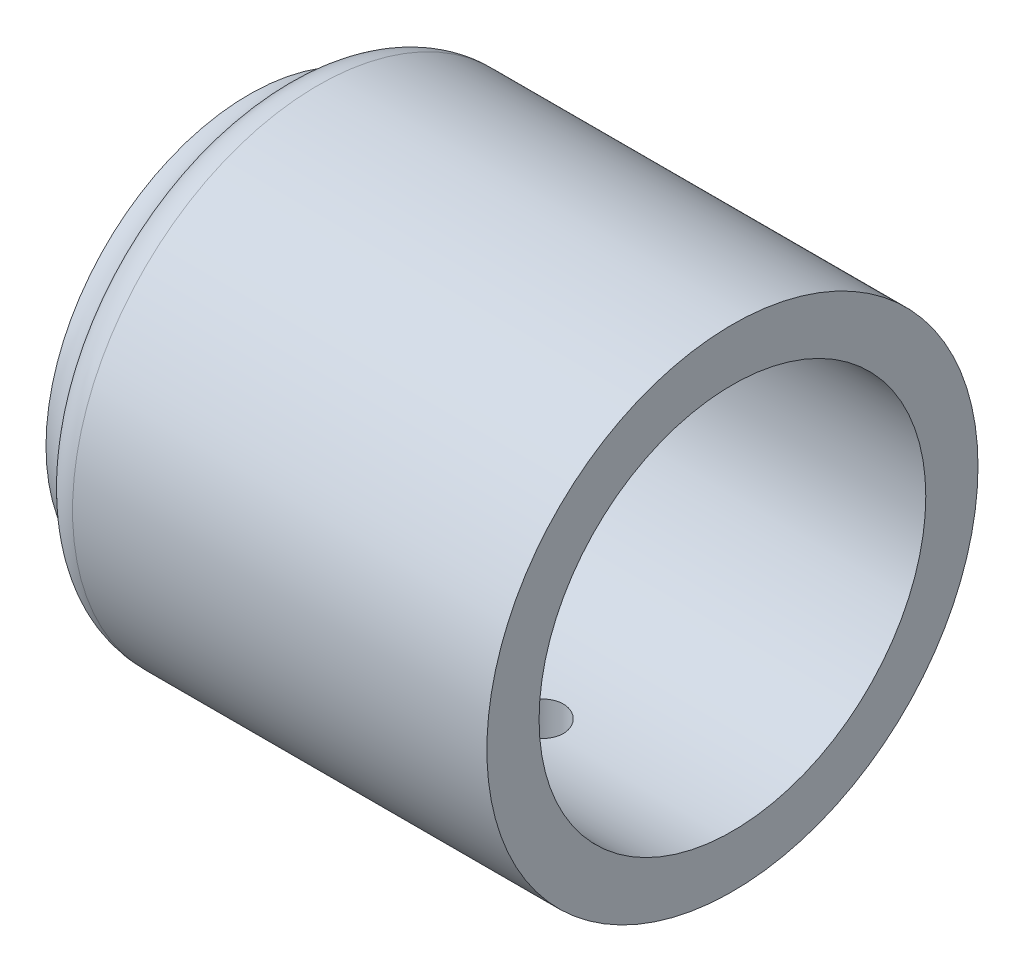
ISO-10303-21;
HEADER;
FILE_DESCRIPTION(('STEP AP214'),'2;1');
FILE_NAME('part.step','',(''),(''),'','','');
FILE_SCHEMA(('AUTOMOTIVE_DESIGN { 1 0 10303 214 1 1 1 1 }'));
ENDSEC;
DATA;
#1=APPLICATION_CONTEXT('core data for automotive mechanical design processes');
#2=APPLICATION_PROTOCOL_DEFINITION('international standard','automotive_design',2000,#1);
#3=PRODUCT_CONTEXT('',#1,'mechanical');
#4=PRODUCT('Part','Part','',(#3));
#5=PRODUCT_RELATED_PRODUCT_CATEGORY('part','',(#4));
#6=PRODUCT_DEFINITION_FORMATION('','',#4);
#7=PRODUCT_DEFINITION_CONTEXT('part definition',#1,'design');
#8=PRODUCT_DEFINITION('design','',#6,#7);
#9=PRODUCT_DEFINITION_SHAPE('','',#8);
#10=(LENGTH_UNIT() NAMED_UNIT(*) SI_UNIT(.MILLI.,.METRE.));
#11=(NAMED_UNIT(*) PLANE_ANGLE_UNIT() SI_UNIT($,.RADIAN.));
#12=(NAMED_UNIT(*) SI_UNIT($,.STERADIAN.) SOLID_ANGLE_UNIT());
#13=UNCERTAINTY_MEASURE_WITH_UNIT(LENGTH_MEASURE(1.E-05),#10,'distance_accuracy_value','');
#14=(GEOMETRIC_REPRESENTATION_CONTEXT(3) GLOBAL_UNCERTAINTY_ASSIGNED_CONTEXT((#13)) GLOBAL_UNIT_ASSIGNED_CONTEXT((#10,
#11,#12)) REPRESENTATION_CONTEXT('',''));
#15=CARTESIAN_POINT('',(0.,0.,0.));
#16=DIRECTION('',(0.,0.,1.));
#17=DIRECTION('',(1.,0.,0.));
#18=AXIS2_PLACEMENT_3D('',#15,#16,#17);
#19=CARTESIAN_POINT('',(0.,0.,0.));
#20=DIRECTION('',(1.,0.,0.));
#21=DIRECTION('',(0.,0.,-1.));
#22=AXIS2_PLACEMENT_3D('',#19,#20,#21);
#23=PLANE('',#22);
#24=CARTESIAN_POINT('',(0.,0.,0.));
#25=DIRECTION('',(1.,0.,0.));
#26=DIRECTION('',(0.,0.,-1.));
#27=AXIS2_PLACEMENT_3D('',#24,#25,#26);
#28=CIRCLE('',#27,20.);
#29=CARTESIAN_POINT('',(0.,0.,-20.));
#30=VERTEX_POINT('',#29);
#31=EDGE_CURVE('E72',#30,#30,#28,.T.);
#32=ORIENTED_EDGE('',*,*,#31,.T.);
#33=EDGE_LOOP('',(#32));
#34=FACE_BOUND('',#33,.T.);
#35=CARTESIAN_POINT('',(0.,0.,0.));
#36=DIRECTION('',(-1.,0.,0.));
#37=DIRECTION('',(0.,0.,1.));
#38=AXIS2_PLACEMENT_3D('',#35,#36,#37);
#39=CIRCLE('',#38,21.);
#40=CARTESIAN_POINT('',(0.,0.,21.));
#41=VERTEX_POINT('',#40);
#42=EDGE_CURVE('E76',#41,#41,#39,.T.);
#43=ORIENTED_EDGE('',*,*,#42,.T.);
#44=EDGE_LOOP('',(#43));
#45=FACE_BOUND('',#44,.T.);
#46=ADVANCED_FACE('F42',(#34,#45),#23,.F.);
#47=CARTESIAN_POINT('',(50.,0.,0.));
#48=DIRECTION('',(-1.,0.,0.));
#49=DIRECTION('',(0.,0.,1.));
#50=AXIS2_PLACEMENT_3D('',#47,#48,#49);
#51=CYLINDRICAL_SURFACE('',#50,25.4);
#52=CARTESIAN_POINT('',(30.,-25.2766690843552,-2.5));
#53=CARTESIAN_POINT('',(29.8599392874787,-25.2766707025076,-2.49999392741206));
#54=CARTESIAN_POINT('',(29.7197856861212,-25.2778457660977,-2.48819016159893));
#55=CARTESIAN_POINT('',(29.4433634814112,-25.2824184676948,-2.44128047461408));
#56=CARTESIAN_POINT('',(29.3070993456217,-25.2858185620687,-2.40614879950283));
#57=CARTESIAN_POINT('',(29.042499161724,-25.2944525432321,-2.31361548797265));
#58=CARTESIAN_POINT('',(28.9141583929871,-25.2996853254849,-2.25622726305069));
#59=CARTESIAN_POINT('',(28.6689589207026,-25.3113937178584,-2.12083545980813));
#60=CARTESIAN_POINT('',(28.552097925335,-25.3178690791454,-2.0428360078297));
#61=CARTESIAN_POINT('',(28.3327350404185,-25.3313586089453,-1.86814015343058));
#62=CARTESIAN_POINT('',(28.230279323911,-25.338374403265,-1.77138589215988));
#63=CARTESIAN_POINT('',(28.0430328421782,-25.3521395241546,-1.56205044121555));
#64=CARTESIAN_POINT('',(27.9582428814143,-25.3588888385781,-1.44946853117488));
#65=CARTESIAN_POINT('',(27.8085757675582,-25.3713765287877,-1.21139142880119));
#66=CARTESIAN_POINT('',(27.7437393912779,-25.3771128243295,-1.08587048373753));
#67=CARTESIAN_POINT('',(27.6360807803164,-25.3869104761499,-0.825657269984008));
#68=CARTESIAN_POINT('',(27.5932580245342,-25.390971872076,-0.690965218475884));
#69=CARTESIAN_POINT('',(27.5309774149862,-25.3969507090018,-0.416699063657356));
#70=CARTESIAN_POINT('',(27.5114438373639,-25.3988750969919,-0.277142309629321));
#71=CARTESIAN_POINT('',(27.4960617896783,-25.4003867093008,0.00328114766783114));
#72=CARTESIAN_POINT('',(27.5002127232328,-25.3999739924685,0.144147817863746));
#73=CARTESIAN_POINT('',(27.5320203503243,-25.3968635881262,0.422678429229586));
#74=CARTESIAN_POINT('',(27.559595617047,-25.3941738161433,0.560351769909405));
#75=CARTESIAN_POINT('',(27.6373423223503,-25.3868207109494,0.829106700869151));
#76=CARTESIAN_POINT('',(27.6875140465715,-25.3821573527906,0.960188207798823));
#77=CARTESIAN_POINT('',(27.8091189067108,-25.371367793819,1.212295463213));
#78=CARTESIAN_POINT('',(27.8805881196542,-25.3652391143255,1.33330369943148));
#79=CARTESIAN_POINT('',(28.0427330119135,-25.3522067066733,1.56163833863171));
#80=CARTESIAN_POINT('',(28.1334092368011,-25.3453029565014,1.66896435283364));
#81=CARTESIAN_POINT('',(28.3318522319633,-25.3314607178719,1.86736479789037));
#82=CARTESIAN_POINT('',(28.4396898276694,-25.3245222062245,1.95836840133708));
#83=CARTESIAN_POINT('',(28.6691487613144,-25.311421690603,2.12099254070412));
#84=CARTESIAN_POINT('',(28.7907701182376,-25.3052596876983,2.19261304992796));
#85=CARTESIAN_POINT('',(29.0443981419079,-25.2944092486617,2.31443737563886));
#86=CARTESIAN_POINT('',(29.1764068894793,-25.2897211087215,2.36463688802348));
#87=CARTESIAN_POINT('',(29.4470358788831,-25.2823552758154,2.44213855795955));
#88=CARTESIAN_POINT('',(29.5856559255879,-25.2796775235534,2.46944139084795));
#89=CARTESIAN_POINT('',(29.8649510155213,-25.2766458431042,2.50028371335105));
#90=CARTESIAN_POINT('',(30.0056150193351,-25.2762822284307,2.50392225803303));
#91=CARTESIAN_POINT('',(30.2855507673178,-25.2778944294066,2.48759279099703));
#92=CARTESIAN_POINT('',(30.4248225296768,-25.2798702144507,2.46762508810791));
#93=CARTESIAN_POINT('',(30.6977320936938,-25.2859297777992,2.40473278000375));
#94=CARTESIAN_POINT('',(30.8313807781694,-25.2900092604671,2.36185494960273));
#95=CARTESIAN_POINT('',(31.089588555958,-25.2998130678128,2.25440726320448));
#96=CARTESIAN_POINT('',(31.2141474472985,-25.3055374290252,2.18983692538473));
#97=CARTESIAN_POINT('',(31.4510915470112,-25.3180094499205,2.04058874071781));
#98=CARTESIAN_POINT('',(31.5634352088847,-25.3247604254314,1.95584521667024));
#99=CARTESIAN_POINT('',(31.7723386590288,-25.338514116495,1.76875042610596));
#100=CARTESIAN_POINT('',(31.8688980686355,-25.345516838082,1.66639873729048));
#101=CARTESIAN_POINT('',(32.043833282406,-25.3590141860495,1.44656345448037));
#102=CARTESIAN_POINT('',(32.1221444940252,-25.3655069551935,1.3290283306926));
#103=CARTESIAN_POINT('',(32.2579159924351,-25.3772258237194,1.08241732180923));
#104=CARTESIAN_POINT('',(32.3153765571509,-25.3824519399847,0.953341590570793));
#105=CARTESIAN_POINT('',(32.4077060706118,-25.3910402537972,0.687539438885161));
#106=CARTESIAN_POINT('',(32.442614127597,-25.394405676498,0.550826711586399));
#107=CARTESIAN_POINT('',(32.4889753669612,-25.3989066288069,0.273445729556827));
#108=CARTESIAN_POINT('',(32.5004291864786,-25.4000422189887,0.132777582380922));
#109=CARTESIAN_POINT('',(32.4995480201901,-25.3999555374787,-0.147886505218638));
#110=CARTESIAN_POINT('',(32.4873133478268,-25.3987432084931,-0.287882774479156));
#111=CARTESIAN_POINT('',(32.439612726853,-25.3941165312991,-0.563821079357839));
#112=CARTESIAN_POINT('',(32.4041467584675,-25.3907021812163,-0.699763111524844));
#113=CARTESIAN_POINT('',(32.3110178574382,-25.3820540700584,-0.963734001490963));
#114=CARTESIAN_POINT('',(32.253357747248,-25.3768205403386,-1.09176386308779));
#115=CARTESIAN_POINT('',(32.1174880831586,-25.3651176694114,-1.33634378008025));
#116=CARTESIAN_POINT('',(32.039278670224,-25.3586483366815,-1.45289391421721));
#117=CARTESIAN_POINT('',(31.8641542147232,-25.3451660004487,-1.67171998838891));
#118=CARTESIAN_POINT('',(31.7671645108072,-25.3381508961263,-1.77393604925729));
#119=CARTESIAN_POINT('',(31.5573788935365,-25.3243854484081,-1.96068724532714));
#120=CARTESIAN_POINT('',(31.4445791892731,-25.3176351690101,-2.04521812783805));
#121=CARTESIAN_POINT('',(31.206071605544,-25.3051457660992,-2.19436328093592));
#122=CARTESIAN_POINT('',(31.0803324899516,-25.2994091848012,-2.25892777408564));
#123=CARTESIAN_POINT('',(30.819822031823,-25.2896270506783,-2.36594118262278));
#124=CARTESIAN_POINT('',(30.6850610927911,-25.2855795877367,-2.40841509231241));
#125=CARTESIAN_POINT('',(30.4579448296993,-25.2806567414123,-2.45942682425293));
#126=CARTESIAN_POINT('',(30.367042425288,-25.2791684214797,-2.47462102981051));
#127=CARTESIAN_POINT('',(30.1841067248924,-25.2771740630597,-2.49490959332244));
#128=CARTESIAN_POINT('',(30.0920734334707,-25.2766680206105,-2.50000399201182));
#129=CARTESIAN_POINT('',(30.,-25.2766690843552,-2.5));
#130=B_SPLINE_CURVE_WITH_KNOTS('',3,(#52,#53,#54,#55,#56,#57,#58,#59,#60,#61,#62,#63,#64,#65,
#66,#67,#68,#69,#70,#71,#72,#73,#74,#75,#76,#77,#78,#79,#80,#81,#82,#83,#84,#85,#86,#87,#88,#89,
#90,#91,#92,#93,#94,#95,#96,#97,#98,#99,#100,#101,#102,#103,#104,#105,#106,#107,#108,#109,#110,
#111,#112,#113,#114,#115,#116,#117,#118,#119,#120,#121,#122,#123,#124,#125,#126,#127,#128,#129),
.UNSPECIFIED.,.T.,.F.,(4,2,2,2,2,2,2,2,2,2,2,2,2,2,2,2,2,2,2,2,2,2,2,2,2,2,2,2,2,2,2,2,2,2,2,2,
2,2,4),(0.,0.419845907555582,0.840156096042314,1.26021340381726,1.68018668026644,
2.10147681527613,2.52278613076175,2.944950795697,3.36710546679036,3.78788374214649,
4.20865142224263,4.62796240244044,5.04727868327153,5.46730934502588,5.88735193927654,
6.30917529948864,6.73099924067836,7.1529078987249,7.57480411214893,7.99493319011988,
8.4150567718107,8.83432586106678,9.25360426352246,9.67426682989536,10.0949394864773,
10.5170793014532,10.9392134893816,11.3606136766808,11.7820024164187,12.2016106073486,
12.621219155459,13.0407743591098,13.4603266847628,13.8815825244112,14.3029395457862,
14.7253387216568,15.1472589302376,15.4232593121736,15.699258580929),.UNSPECIFIED.);
#131=CARTESIAN_POINT('',(30.,-25.2766690843552,-2.5));
#132=VERTEX_POINT('',#131);
#133=EDGE_CURVE('E10',#132,#132,#130,.T.);
#134=ORIENTED_EDGE('',*,*,#133,.T.);
#135=EDGE_LOOP('',(#134));
#136=FACE_BOUND('',#135,.T.);
#137=CARTESIAN_POINT('',(7.1442284397967,0.,0.));
#138=DIRECTION('',(1.,0.,0.));
#139=DIRECTION('',(0.,0.,-1.));
#140=AXIS2_PLACEMENT_3D('',#137,#138,#139);
#141=CIRCLE('',#140,25.4);
#142=CARTESIAN_POINT('',(7.1442284397967,0.,-25.4));
#143=VERTEX_POINT('',#142);
#144=EDGE_CURVE('E55',#143,#143,#141,.T.);
#145=ORIENTED_EDGE('',*,*,#144,.T.);
#146=EDGE_LOOP('',(#145));
#147=FACE_BOUND('',#146,.T.);
#148=CARTESIAN_POINT('',(50.,0.,0.));
#149=DIRECTION('',(1.,0.,0.));
#150=DIRECTION('',(0.,0.,-1.));
#151=AXIS2_PLACEMENT_3D('',#148,#149,#150);
#152=CIRCLE('',#151,25.4);
#153=CARTESIAN_POINT('',(50.,0.,-25.4));
#154=VERTEX_POINT('',#153);
#155=EDGE_CURVE('E65',#154,#154,#152,.T.);
#156=ORIENTED_EDGE('',*,*,#155,.F.);
#157=EDGE_LOOP('',(#156));
#158=FACE_BOUND('',#157,.T.);
#159=ADVANCED_FACE('F105',(#136,#147,#158),#51,.T.);
#160=CARTESIAN_POINT('',(50.,0.,0.));
#161=DIRECTION('',(1.,0.,0.));
#162=DIRECTION('',(0.,0.,-1.));
#163=AXIS2_PLACEMENT_3D('',#160,#161,#162);
#164=PLANE('',#163);
#165=ORIENTED_EDGE('',*,*,#155,.T.);
#166=EDGE_LOOP('',(#165));
#167=FACE_BOUND('',#166,.T.);
#168=CARTESIAN_POINT('',(50.,0.,0.));
#169=DIRECTION('',(1.,0.,0.));
#170=DIRECTION('',(0.,0.,-1.));
#171=AXIS2_PLACEMENT_3D('',#168,#169,#170);
#172=CIRCLE('',#171,20.);
#173=CARTESIAN_POINT('',(50.,0.,-20.));
#174=VERTEX_POINT('',#173);
#175=EDGE_CURVE('E71',#174,#174,#172,.T.);
#176=ORIENTED_EDGE('',*,*,#175,.F.);
#177=EDGE_LOOP('',(#176));
#178=FACE_BOUND('',#177,.T.);
#179=ADVANCED_FACE('F112',(#167,#178),#164,.T.);
#180=CARTESIAN_POINT('',(50.,0.,0.));
#181=DIRECTION('',(-1.,0.,0.));
#182=DIRECTION('',(0.,0.,1.));
#183=AXIS2_PLACEMENT_3D('',#180,#181,#182);
#184=CYLINDRICAL_SURFACE('',#183,20.);
#185=CARTESIAN_POINT('',(30.,-19.8431348329844,-2.5));
#186=CARTESIAN_POINT('',(29.8601637161995,-19.8431368414673,-2.49999405483337));
#187=CARTESIAN_POINT('',(29.7202400350694,-19.8446289499888,-2.48822789901659));
#188=CARTESIAN_POINT('',(29.4442867745715,-19.8504339085542,-2.44147641371666));
#189=CARTESIAN_POINT('',(29.3082614194982,-19.8547497060959,-2.4064668210908));
#190=CARTESIAN_POINT('',(29.0441401178924,-19.8657057380876,-2.31427669282773));
#191=CARTESIAN_POINT('',(28.9160388578836,-19.8723443946258,-2.25711120479871));
#192=CARTESIAN_POINT('',(28.6712715481747,-19.8871962351098,-2.12226419842905));
#193=CARTESIAN_POINT('',(28.5546035482563,-19.8954091498188,-2.04458618737466));
#194=CARTESIAN_POINT('',(28.3353377528785,-19.9125355924631,-1.87045345026454));
#195=CARTESIAN_POINT('',(28.2328131976813,-19.9214524170269,-1.77390681502433));
#196=CARTESIAN_POINT('',(28.0453772310608,-19.9389523287519,-1.56497526067119));
#197=CARTESIAN_POINT('',(27.9604666959053,-19.9475353992921,-1.45258955405802));
#198=CARTESIAN_POINT('',(27.8104064204937,-19.96343444613,-1.21470983067598));
#199=CARTESIAN_POINT('',(27.7453229549004,-19.9707461384685,-1.08917369556111));
#200=CARTESIAN_POINT('',(27.637188800059,-19.9832423695448,-0.828846718055913));
#201=CARTESIAN_POINT('',(27.5941372930735,-19.9884269872295,-0.694056219360903));
#202=CARTESIAN_POINT('',(27.5315079316656,-19.9960616870624,-0.419795687751112));
#203=CARTESIAN_POINT('',(27.5118083214761,-19.9985259483594,-0.280353859663378));
#204=CARTESIAN_POINT('',(27.4960646149635,-20.0004906972921,-0.000123200686546386));
#205=CARTESIAN_POINT('',(27.5000195880475,-19.9999913015208,0.140665576994771));
#206=CARTESIAN_POINT('',(27.5313752027574,-19.9960964777001,0.418765268974547));
#207=CARTESIAN_POINT('',(27.5586448984814,-19.9927172245573,0.556091205764452));
#208=CARTESIAN_POINT('',(27.6356511766299,-19.9834605594233,0.824202163905374));
#209=CARTESIAN_POINT('',(27.6853881861668,-19.9775830999405,0.954987060856204));
#210=CARTESIAN_POINT('',(27.8060564927838,-19.9639625780791,1.20670881543864));
#211=CARTESIAN_POINT('',(27.8770444577302,-19.9562145384324,1.32761822784052));
#212=CARTESIAN_POINT('',(28.038158362216,-19.9397196906528,1.55585745230647));
#213=CARTESIAN_POINT('',(28.1282851794686,-19.9309728367226,1.66318664121735));
#214=CARTESIAN_POINT('',(28.3258518185984,-19.9133886752351,1.86198803077294));
#215=CARTESIAN_POINT('',(28.4334057595467,-19.9045511580473,1.95334683999599));
#216=CARTESIAN_POINT('',(28.6623815567825,-19.8878407194058,2.1167328506251));
#217=CARTESIAN_POINT('',(28.7838034565381,-19.8799678009758,2.18875999143509));
#218=CARTESIAN_POINT('',(29.0371694955623,-19.8660780261272,2.31144457358273));
#219=CARTESIAN_POINT('',(29.1691180799532,-19.8600619590813,2.36209292986232));
#220=CARTESIAN_POINT('',(29.4397394535268,-19.8505824249596,2.44048165446808));
#221=CARTESIAN_POINT('',(29.5784119183087,-19.847118834867,2.46822312679961));
#222=CARTESIAN_POINT('',(29.8575431819998,-19.8431588878405,2.4998604319086));
#223=CARTESIAN_POINT('',(29.9979836230888,-19.8426426744238,2.50391584199828));
#224=CARTESIAN_POINT('',(30.2775419296654,-19.8445834111965,2.48848695323055));
#225=CARTESIAN_POINT('',(30.4166598232793,-19.8470402980145,2.4690031561098));
#226=CARTESIAN_POINT('',(30.6891457635779,-19.8546322848399,2.40718328579772));
#227=CARTESIAN_POINT('',(30.8225316151904,-19.8597583269466,2.36492448374606));
#228=CARTESIAN_POINT('',(31.0803241548532,-19.8721036997081,2.25883371911612));
#229=CARTESIAN_POINT('',(31.2047305272409,-19.8793231039076,2.19500099858122));
#230=CARTESIAN_POINT('',(31.441754643813,-19.8950893135323,2.04718202215492));
#231=CARTESIAN_POINT('',(31.5543066653144,-19.9036429273708,1.9630911195771));
#232=CARTESIAN_POINT('',(31.763756553935,-19.9210923955102,1.77729074236895));
#233=CARTESIAN_POINT('',(31.860653811868,-19.9299882631129,1.67558058242548));
#234=CARTESIAN_POINT('',(32.0366041873344,-19.9471808868696,1.45673177555852));
#235=CARTESIAN_POINT('',(32.115552446795,-19.9554739391252,1.33950849211703));
#236=CARTESIAN_POINT('',(32.2526382176338,-19.9704711303161,1.09337258168179));
#237=CARTESIAN_POINT('',(32.310776148481,-19.9771753012772,0.964460190368319));
#238=CARTESIAN_POINT('',(32.404417786908,-19.9882229065319,0.69895385913945));
#239=CARTESIAN_POINT('',(32.4399820960316,-19.992572656877,0.562381566511776));
#240=CARTESIAN_POINT('',(32.4876640892268,-19.9984475467757,0.285146057277958));
#241=CARTESIAN_POINT('',(32.4997828305992,-19.9999728137019,0.144483025438106));
#242=CARTESIAN_POINT('',(32.5002099222922,-20.0000262801365,-0.13591718334378));
#243=CARTESIAN_POINT('',(32.488679960568,-19.998574831678,-0.275654137714725));
#244=CARTESIAN_POINT('',(32.4424793865691,-19.9928784115798,-0.55118774145262));
#245=CARTESIAN_POINT('',(32.4078087903882,-19.9886334418829,-0.686984393559877));
#246=CARTESIAN_POINT('',(32.3163618856504,-19.9778248521189,-0.950761442987285));
#247=CARTESIAN_POINT('',(32.259593320627,-19.9712620443393,-1.07874456015946));
#248=CARTESIAN_POINT('',(32.1255786853922,-19.9565444760682,-1.32339333714413));
#249=CARTESIAN_POINT('',(32.0483323717374,-19.9483896966512,-1.44005886238844));
#250=CARTESIAN_POINT('',(31.8749567846645,-19.9313319392356,-1.65958676796215));
#251=CARTESIAN_POINT('',(31.7787072064796,-19.9224244127137,-1.76235378783277));
#252=CARTESIAN_POINT('',(31.5703070559679,-19.9049015902109,-1.95034111882087));
#253=CARTESIAN_POINT('',(31.4581527224968,-19.8962863639518,-2.0355572677992));
#254=CARTESIAN_POINT('',(31.220630077313,-19.8802881136638,-2.18630524251152));
#255=CARTESIAN_POINT('',(31.0952124101068,-19.8729099764648,-2.2517597831474));
#256=CARTESIAN_POINT('',(30.8351432594475,-19.8602785801803,-2.36058528832414));
#257=CARTESIAN_POINT('',(30.7005020007077,-19.8550230113382,-2.40398027122393));
#258=CARTESIAN_POINT('',(30.4709700129508,-19.8485078683333,-2.4570658962405));
#259=CARTESIAN_POINT('',(30.3775270484603,-19.8465030152112,-2.47314303101111));
#260=CARTESIAN_POINT('',(30.1894027500352,-19.8438158223071,-2.49461205590497));
#261=CARTESIAN_POINT('',(30.0947214255021,-19.8431334724909,-2.5000040270997));
#262=CARTESIAN_POINT('',(30.,-19.8431348329844,-2.5));
#263=B_SPLINE_CURVE_WITH_KNOTS('',3,(#185,#186,#187,#188,#189,#190,#191,#192,#193,#194,#195,
#196,#197,#198,#199,#200,#201,#202,#203,#204,#205,#206,#207,#208,#209,#210,#211,#212,#213,#214,
#215,#216,#217,#218,#219,#220,#221,#222,#223,#224,#225,#226,#227,#228,#229,#230,#231,#232,#233,
#234,#235,#236,#237,#238,#239,#240,#241,#242,#243,#244,#245,#246,#247,#248,#249,#250,#251,#252,
#253,#254,#255,#256,#257,#258,#259,#260,#261,#262),.UNSPECIFIED.,.T.,.F.,(4,2,2,2,2,2,2,2,2,2,2,
2,2,2,2,2,2,2,2,2,2,2,2,2,2,2,2,2,2,2,2,2,2,2,2,2,2,2,4),(0.,0.419162817491662,
0.838763876176503,1.25808045260532,1.67732537953025,2.09866577551478,2.52002712744991,
2.94278186148153,3.36552090342242,3.78604596943869,4.2065544917252,4.6247166493545,
5.04288675674201,5.46218204415215,5.88149656471516,6.30367697380181,6.72585870621836,
7.1482196674142,7.57056027158599,7.99005217808294,8.40953514329526,8.82760376295144,
9.24568707214264,9.66597819546522,10.0862856699722,10.5089888589475,10.9316835271129,
11.3532385678735,11.7747745977522,12.1934381629067,12.612101436892,13.030618135465,
13.4491398096666,13.8704012889325,14.2917625544224,14.7147509770793,15.1372778598593,
15.4212098963686,15.7051397785939),.UNSPECIFIED.);
#264=CARTESIAN_POINT('',(30.,-19.8431348329844,-2.5));
#265=VERTEX_POINT('',#264);
#266=EDGE_CURVE('E83',#265,#265,#263,.T.);
#267=ORIENTED_EDGE('',*,*,#266,.F.);
#268=EDGE_LOOP('',(#267));
#269=FACE_BOUND('',#268,.T.);
#270=ORIENTED_EDGE('',*,*,#175,.T.);
#271=EDGE_LOOP('',(#270));
#272=FACE_BOUND('',#271,.T.);
#273=ORIENTED_EDGE('',*,*,#31,.F.);
#274=EDGE_LOOP('',(#273));
#275=FACE_BOUND('',#274,.T.);
#276=ADVANCED_FACE('F90',(#269,#272,#275),#184,.F.);
#277=CARTESIAN_POINT('',(0.,0.,0.));
#278=DIRECTION('',(-1.,0.,0.));
#279=DIRECTION('',(0.,0.,1.));
#280=AXIS2_PLACEMENT_3D('',#277,#278,#279);
#281=TOROIDAL_SURFACE('',#280,25.,4.);
#282=CARTESIAN_POINT('',(3.57211421989843,0.,0.));
#283=DIRECTION('',(-1.,0.,0.));
#284=DIRECTION('',(0.,0.,1.));
#285=AXIS2_PLACEMENT_3D('',#282,#283,#284);
#286=CIRCLE('',#285,23.2);
#287=CARTESIAN_POINT('',(3.57211421989843,0.,23.2));
#288=VERTEX_POINT('',#287);
#289=EDGE_CURVE('E60',#288,#288,#286,.T.);
#290=ORIENTED_EDGE('',*,*,#289,.T.);
#291=EDGE_LOOP('',(#290));
#292=FACE_BOUND('',#291,.T.);
#293=ORIENTED_EDGE('',*,*,#42,.F.);
#294=EDGE_LOOP('',(#293));
#295=FACE_BOUND('',#294,.T.);
#296=ADVANCED_FACE('F101',(#292,#295),#281,.F.);
#297=CARTESIAN_POINT('',(7.1442284397967,0.,0.));
#298=DIRECTION('',(1.,0.,0.));
#299=DIRECTION('',(0.,0.,-1.));
#300=AXIS2_PLACEMENT_3D('',#297,#298,#299);
#301=TOROIDAL_SURFACE('',#300,21.4,4.);
#302=ORIENTED_EDGE('',*,*,#144,.F.);
#303=EDGE_LOOP('',(#302));
#304=FACE_BOUND('',#303,.T.);
#305=ORIENTED_EDGE('',*,*,#289,.F.);
#306=EDGE_LOOP('',(#305));
#307=FACE_BOUND('',#306,.T.);
#308=ADVANCED_FACE('F44',(#304,#307),#301,.T.);
#309=CARTESIAN_POINT('',(30.,-25.4,0.));
#310=DIRECTION('',(0.,-1.,0.));
#311=DIRECTION('',(0.,0.,-1.));
#312=AXIS2_PLACEMENT_3D('',#309,#310,#311);
#313=CYLINDRICAL_SURFACE('',#312,2.5);
#314=ORIENTED_EDGE('',*,*,#266,.T.);
#315=EDGE_LOOP('',(#314));
#316=FACE_BOUND('',#315,.T.);
#317=ORIENTED_EDGE('',*,*,#133,.F.);
#318=EDGE_LOOP('',(#317));
#319=FACE_BOUND('',#318,.T.);
#320=ADVANCED_FACE('F93',(#316,#319),#313,.F.);
#321=CLOSED_SHELL('',(#46,#159,#179,#276,#296,#308,#320));
#322=MANIFOLD_SOLID_BREP('B2',#321);
#323=ADVANCED_BREP_SHAPE_REPRESENTATION('',(#18,#322),#14);
#324=SHAPE_DEFINITION_REPRESENTATION(#9,#323);
ENDSEC;
END-ISO-10303-21;
